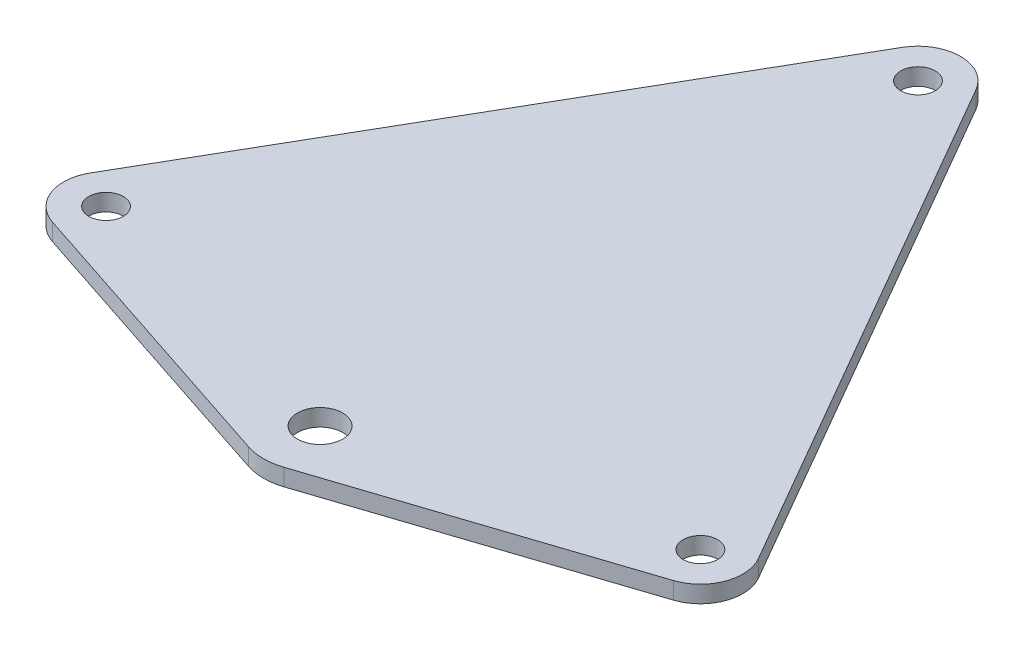
ISO-10303-21;
HEADER;
FILE_DESCRIPTION(('STEP AP214'),'2;1');
FILE_NAME('part.step','',(''),(''),'','','');
FILE_SCHEMA(('AUTOMOTIVE_DESIGN { 1 0 10303 214 1 1 1 1 }'));
ENDSEC;
DATA;
#1=APPLICATION_CONTEXT('core data for automotive mechanical design processes');
#2=APPLICATION_PROTOCOL_DEFINITION('international standard','automotive_design',2000,#1);
#3=PRODUCT_CONTEXT('',#1,'mechanical');
#4=PRODUCT('Part','Part','',(#3));
#5=PRODUCT_RELATED_PRODUCT_CATEGORY('part','',(#4));
#6=PRODUCT_DEFINITION_FORMATION('','',#4);
#7=PRODUCT_DEFINITION_CONTEXT('part definition',#1,'design');
#8=PRODUCT_DEFINITION('design','',#6,#7);
#9=PRODUCT_DEFINITION_SHAPE('','',#8);
#10=(LENGTH_UNIT() NAMED_UNIT(*) SI_UNIT(.MILLI.,.METRE.));
#11=(NAMED_UNIT(*) PLANE_ANGLE_UNIT() SI_UNIT($,.RADIAN.));
#12=(NAMED_UNIT(*) SI_UNIT($,.STERADIAN.) SOLID_ANGLE_UNIT());
#13=UNCERTAINTY_MEASURE_WITH_UNIT(LENGTH_MEASURE(1.E-05),#10,'distance_accuracy_value','');
#14=(GEOMETRIC_REPRESENTATION_CONTEXT(3) GLOBAL_UNCERTAINTY_ASSIGNED_CONTEXT((#13)) GLOBAL_UNIT_ASSIGNED_CONTEXT((#10,
#11,#12)) REPRESENTATION_CONTEXT('',''));
#15=CARTESIAN_POINT('',(0.,0.,0.));
#16=DIRECTION('',(0.,0.,1.));
#17=DIRECTION('',(1.,0.,0.));
#18=AXIS2_PLACEMENT_3D('',#15,#16,#17);
#19=CARTESIAN_POINT('',(-52.5,3.,30.3108891324553));
#20=DIRECTION('',(0.,-1.,0.));
#21=DIRECTION('',(0.,0.,-1.));
#22=AXIS2_PLACEMENT_3D('',#19,#20,#21);
#23=CYLINDRICAL_SURFACE('',#22,7.5);
#24=CARTESIAN_POINT('',(-52.5,0.,30.3108891324553));
#25=DIRECTION('',(0.,1.,0.));
#26=DIRECTION('',(0.,0.,1.));
#27=AXIS2_PLACEMENT_3D('',#24,#25,#26);
#28=CIRCLE('',#27,7.5);
#29=CARTESIAN_POINT('',(-54.8499234084128,0.,37.4332384621775));
#30=VERTEX_POINT('',#29);
#31=CARTESIAN_POINT('',(-58.9951905283833,0.,26.5608891324553));
#32=VERTEX_POINT('',#31);
#33=EDGE_CURVE('E146',#30,#32,#28,.F.);
#34=ORIENTED_EDGE('',*,*,#33,.F.);
#35=DIRECTION('',(0.,-1.,0.));
#36=VECTOR('',#35,1.);
#37=CARTESIAN_POINT('',(-54.8499234084128,3.,37.4332384621775));
#38=LINE('',#37,#36);
#39=CARTESIAN_POINT('',(-54.8499234084128,3.,37.4332384621775));
#40=VERTEX_POINT('',#39);
#41=EDGE_CURVE('E11',#40,#30,#38,.T.);
#42=ORIENTED_EDGE('',*,*,#41,.F.);
#43=CARTESIAN_POINT('',(-52.5,3.,30.3108891324553));
#44=DIRECTION('',(0.,1.,0.));
#45=DIRECTION('',(0.,0.,1.));
#46=AXIS2_PLACEMENT_3D('',#43,#44,#45);
#47=CIRCLE('',#46,7.5);
#48=CARTESIAN_POINT('',(-58.9951905283833,3.,26.5608891324553));
#49=VERTEX_POINT('',#48);
#50=EDGE_CURVE('E175',#40,#49,#47,.F.);
#51=ORIENTED_EDGE('',*,*,#50,.T.);
#52=DIRECTION('',(0.,-1.,0.));
#53=VECTOR('',#52,1.);
#54=CARTESIAN_POINT('',(-58.9951905283833,3.,26.5608891324553));
#55=LINE('',#54,#53);
#56=EDGE_CURVE('E89',#49,#32,#55,.T.);
#57=ORIENTED_EDGE('',*,*,#56,.T.);
#58=EDGE_LOOP('',(#34,#42,#51,#57));
#59=FACE_BOUND('',#58,.T.);
#60=ADVANCED_FACE('F39',(#59),#23,.T.);
#61=CARTESIAN_POINT('',(-16.5228115414628,3.,50.0787537526378));
#62=DIRECTION('',(0.313323121121704,0.,-0.949646577296288));
#63=DIRECTION('',(-0.949646577296288,0.,-0.313323121121704));
#64=AXIS2_PLACEMENT_3D('',#61,#62,#63);
#65=PLANE('',#64);
#66=DIRECTION('',(0.949646577296288,0.,0.313323121121704));
#67=VECTOR('',#66,1.);
#68=CARTESIAN_POINT('',(-16.5228115414628,0.,50.0787537526378));
#69=LINE('',#68,#67);
#70=CARTESIAN_POINT('',(-3.13323121121704,0.,54.4964657729629));
#71=VERTEX_POINT('',#70);
#72=EDGE_CURVE('E149',#30,#71,#69,.T.);
#73=ORIENTED_EDGE('',*,*,#72,.T.);
#74=DIRECTION('',(0.,-1.,0.));
#75=VECTOR('',#74,1.);
#76=CARTESIAN_POINT('',(-3.13323121121704,3.,54.4964657729629));
#77=LINE('',#76,#75);
#78=CARTESIAN_POINT('',(-3.13323121121704,3.,54.4964657729629));
#79=VERTEX_POINT('',#78);
#80=EDGE_CURVE('E47',#79,#71,#77,.T.);
#81=ORIENTED_EDGE('',*,*,#80,.F.);
#82=DIRECTION('',(0.949646577296288,0.,0.313323121121704));
#83=VECTOR('',#82,1.);
#84=CARTESIAN_POINT('',(-16.5228115414628,3.,50.0787537526378));
#85=LINE('',#84,#83);
#86=EDGE_CURVE('E202',#40,#79,#85,.T.);
#87=ORIENTED_EDGE('',*,*,#86,.F.);
#88=ORIENTED_EDGE('',*,*,#41,.T.);
#89=EDGE_LOOP('',(#73,#81,#87,#88));
#90=FACE_BOUND('',#89,.T.);
#91=ADVANCED_FACE('F206',(#90),#65,.F.);
#92=CARTESIAN_POINT('',(0.,3.,45.));
#93=DIRECTION('',(0.,-1.,0.));
#94=DIRECTION('',(0.,0.,-1.));
#95=AXIS2_PLACEMENT_3D('',#92,#93,#94);
#96=CYLINDRICAL_SURFACE('',#95,9.99999999999999);
#97=CARTESIAN_POINT('',(0.,0.,45.));
#98=DIRECTION('',(0.,1.,0.));
#99=DIRECTION('',(0.,0.,1.));
#100=AXIS2_PLACEMENT_3D('',#97,#98,#99);
#101=CIRCLE('',#100,9.99999999999999);
#102=CARTESIAN_POINT('',(3.13323121121705,0.,54.4964657729629));
#103=VERTEX_POINT('',#102);
#104=EDGE_CURVE('E151',#71,#103,#101,.T.);
#105=ORIENTED_EDGE('',*,*,#104,.T.);
#106=DIRECTION('',(0.,-1.,0.));
#107=VECTOR('',#106,1.);
#108=CARTESIAN_POINT('',(3.13323121121705,3.,54.4964657729629));
#109=LINE('',#108,#107);
#110=CARTESIAN_POINT('',(3.13323121121705,3.,54.4964657729629));
#111=VERTEX_POINT('',#110);
#112=EDGE_CURVE('E181',#111,#103,#109,.T.);
#113=ORIENTED_EDGE('',*,*,#112,.F.);
#114=CARTESIAN_POINT('',(0.,3.,45.));
#115=DIRECTION('',(0.,1.,0.));
#116=DIRECTION('',(0.,0.,1.));
#117=AXIS2_PLACEMENT_3D('',#114,#115,#116);
#118=CIRCLE('',#117,9.99999999999999);
#119=EDGE_CURVE('E190',#79,#111,#118,.T.);
#120=ORIENTED_EDGE('',*,*,#119,.F.);
#121=ORIENTED_EDGE('',*,*,#80,.T.);
#122=EDGE_LOOP('',(#105,#113,#120,#121));
#123=FACE_BOUND('',#122,.T.);
#124=ADVANCED_FACE('F188',(#123),#96,.T.);
#125=CARTESIAN_POINT('',(16.5228115414628,3.,50.0787537526378));
#126=DIRECTION('',(-0.313323121121704,0.,-0.949646577296288));
#127=DIRECTION('',(-0.949646577296288,0.,0.313323121121704));
#128=AXIS2_PLACEMENT_3D('',#125,#126,#127);
#129=PLANE('',#128);
#130=DIRECTION('',(0.949646577296288,0.,-0.313323121121704));
#131=VECTOR('',#130,1.);
#132=CARTESIAN_POINT('',(16.5228115414628,0.,50.0787537526378));
#133=LINE('',#132,#131);
#134=CARTESIAN_POINT('',(54.8499234084128,0.,37.4332384621775));
#135=VERTEX_POINT('',#134);
#136=EDGE_CURVE('E153',#103,#135,#133,.T.);
#137=ORIENTED_EDGE('',*,*,#136,.T.);
#138=DIRECTION('',(0.,-1.,0.));
#139=VECTOR('',#138,1.);
#140=CARTESIAN_POINT('',(54.8499234084128,3.,37.4332384621775));
#141=LINE('',#140,#139);
#142=CARTESIAN_POINT('',(54.8499234084128,3.,37.4332384621775));
#143=VERTEX_POINT('',#142);
#144=EDGE_CURVE('E179',#143,#135,#141,.T.);
#145=ORIENTED_EDGE('',*,*,#144,.F.);
#146=DIRECTION('',(0.949646577296288,0.,-0.313323121121704));
#147=VECTOR('',#146,1.);
#148=CARTESIAN_POINT('',(16.5228115414628,3.,50.0787537526378));
#149=LINE('',#148,#147);
#150=EDGE_CURVE('E129',#111,#143,#149,.T.);
#151=ORIENTED_EDGE('',*,*,#150,.F.);
#152=ORIENTED_EDGE('',*,*,#112,.T.);
#153=EDGE_LOOP('',(#137,#145,#151,#152));
#154=FACE_BOUND('',#153,.T.);
#155=ADVANCED_FACE('F200',(#154),#129,.F.);
#156=CARTESIAN_POINT('',(52.5,3.,30.3108891324553));
#157=DIRECTION('',(0.,-1.,0.));
#158=DIRECTION('',(0.,0.,-1.));
#159=AXIS2_PLACEMENT_3D('',#156,#157,#158);
#160=CYLINDRICAL_SURFACE('',#159,7.49999999999999);
#161=CARTESIAN_POINT('',(52.5,0.,30.3108891324553));
#162=DIRECTION('',(0.,1.,0.));
#163=DIRECTION('',(0.,0.,1.));
#164=AXIS2_PLACEMENT_3D('',#161,#162,#163);
#165=CIRCLE('',#164,7.49999999999999);
#166=CARTESIAN_POINT('',(58.9951905283833,0.,26.5608891324553));
#167=VERTEX_POINT('',#166);
#168=EDGE_CURVE('E156',#167,#135,#165,.F.);
#169=ORIENTED_EDGE('',*,*,#168,.F.);
#170=DIRECTION('',(0.,-1.,0.));
#171=VECTOR('',#170,1.);
#172=CARTESIAN_POINT('',(58.9951905283833,3.,26.5608891324553));
#173=LINE('',#172,#171);
#174=CARTESIAN_POINT('',(58.9951905283833,3.,26.5608891324553));
#175=VERTEX_POINT('',#174);
#176=EDGE_CURVE('E117',#175,#167,#173,.T.);
#177=ORIENTED_EDGE('',*,*,#176,.F.);
#178=CARTESIAN_POINT('',(52.5,3.,30.3108891324553));
#179=DIRECTION('',(0.,1.,0.));
#180=DIRECTION('',(0.,0.,1.));
#181=AXIS2_PLACEMENT_3D('',#178,#179,#180);
#182=CIRCLE('',#181,7.49999999999999);
#183=EDGE_CURVE('E127',#175,#143,#182,.F.);
#184=ORIENTED_EDGE('',*,*,#183,.T.);
#185=ORIENTED_EDGE('',*,*,#144,.T.);
#186=EDGE_LOOP('',(#169,#177,#184,#185));
#187=FACE_BOUND('',#186,.T.);
#188=ADVANCED_FACE('F216',(#187),#160,.T.);
#189=CARTESIAN_POINT('',(32.7451905283833,3.,-18.9054445662277));
#190=DIRECTION('',(0.866025403784439,0.,-0.5));
#191=DIRECTION('',(-0.5,0.,-0.866025403784439));
#192=AXIS2_PLACEMENT_3D('',#189,#190,#191);
#193=PLANE('',#192);
#194=DIRECTION('',(0.5,0.,0.866025403784439));
#195=VECTOR('',#194,1.);
#196=CARTESIAN_POINT('',(32.7451905283833,0.,-18.9054445662277));
#197=LINE('',#196,#195);
#198=CARTESIAN_POINT('',(6.4951905283833,0.,-64.3717782649107));
#199=VERTEX_POINT('',#198);
#200=EDGE_CURVE('E116',#199,#167,#197,.T.);
#201=ORIENTED_EDGE('',*,*,#200,.F.);
#202=DIRECTION('',(0.,-1.,0.));
#203=VECTOR('',#202,1.);
#204=CARTESIAN_POINT('',(6.4951905283833,3.,-64.3717782649107));
#205=LINE('',#204,#203);
#206=CARTESIAN_POINT('',(6.4951905283833,3.,-64.3717782649107));
#207=VERTEX_POINT('',#206);
#208=EDGE_CURVE('E110',#207,#199,#205,.T.);
#209=ORIENTED_EDGE('',*,*,#208,.F.);
#210=DIRECTION('',(0.5,0.,0.866025403784439));
#211=VECTOR('',#210,1.);
#212=CARTESIAN_POINT('',(32.7451905283833,3.,-18.9054445662277));
#213=LINE('',#212,#211);
#214=EDGE_CURVE('E114',#207,#175,#213,.T.);
#215=ORIENTED_EDGE('',*,*,#214,.T.);
#216=ORIENTED_EDGE('',*,*,#176,.T.);
#217=EDGE_LOOP('',(#201,#209,#215,#216));
#218=FACE_BOUND('',#217,.T.);
#219=ADVANCED_FACE('F112',(#218),#193,.T.);
#220=CARTESIAN_POINT('',(0.,3.,-60.6217782649107));
#221=DIRECTION('',(0.,-1.,0.));
#222=DIRECTION('',(0.,0.,-1.));
#223=AXIS2_PLACEMENT_3D('',#220,#221,#222);
#224=CYLINDRICAL_SURFACE('',#223,7.5);
#225=CARTESIAN_POINT('',(0.,0.,-60.6217782649107));
#226=DIRECTION('',(0.,1.,0.));
#227=DIRECTION('',(0.,0.,1.));
#228=AXIS2_PLACEMENT_3D('',#225,#226,#227);
#229=CIRCLE('',#228,7.5);
#230=CARTESIAN_POINT('',(-6.4951905283833,0.,-64.3717782649107));
#231=VERTEX_POINT('',#230);
#232=EDGE_CURVE('E82',#199,#231,#229,.T.);
#233=ORIENTED_EDGE('',*,*,#232,.T.);
#234=DIRECTION('',(0.,-1.,0.));
#235=VECTOR('',#234,1.);
#236=CARTESIAN_POINT('',(-6.4951905283833,3.,-64.3717782649107));
#237=LINE('',#236,#235);
#238=CARTESIAN_POINT('',(-6.4951905283833,3.,-64.3717782649107));
#239=VERTEX_POINT('',#238);
#240=EDGE_CURVE('E118',#239,#231,#237,.T.);
#241=ORIENTED_EDGE('',*,*,#240,.F.);
#242=CARTESIAN_POINT('',(0.,3.,-60.6217782649107));
#243=DIRECTION('',(0.,1.,0.));
#244=DIRECTION('',(0.,0.,1.));
#245=AXIS2_PLACEMENT_3D('',#242,#243,#244);
#246=CIRCLE('',#245,7.5);
#247=EDGE_CURVE('E120',#207,#239,#246,.T.);
#248=ORIENTED_EDGE('',*,*,#247,.F.);
#249=ORIENTED_EDGE('',*,*,#208,.T.);
#250=EDGE_LOOP('',(#233,#241,#248,#249));
#251=FACE_BOUND('',#250,.T.);
#252=ADVANCED_FACE('F121',(#251),#224,.T.);
#253=CARTESIAN_POINT('',(0.,3.,-60.6217782649107));
#254=DIRECTION('',(0.,-1.,0.));
#255=DIRECTION('',(0.,0.,-1.));
#256=AXIS2_PLACEMENT_3D('',#253,#254,#255);
#257=CYLINDRICAL_SURFACE('',#256,3.05);
#258=CARTESIAN_POINT('',(0.,3.,-60.6217782649107));
#259=DIRECTION('',(0.,1.,0.));
#260=DIRECTION('',(0.,0.,1.));
#261=AXIS2_PLACEMENT_3D('',#258,#259,#260);
#262=CIRCLE('',#261,3.05);
#263=CARTESIAN_POINT('',(0.,3.,-57.5717782649107));
#264=VERTEX_POINT('',#263);
#265=EDGE_CURVE('E140',#264,#264,#262,.T.);
#266=ORIENTED_EDGE('',*,*,#265,.T.);
#267=EDGE_LOOP('',(#266));
#268=FACE_BOUND('',#267,.T.);
#269=CARTESIAN_POINT('',(0.,0.,-60.6217782649107));
#270=DIRECTION('',(0.,1.,0.));
#271=DIRECTION('',(0.,0.,1.));
#272=AXIS2_PLACEMENT_3D('',#269,#270,#271);
#273=CIRCLE('',#272,3.05);
#274=CARTESIAN_POINT('',(0.,0.,-57.5717782649107));
#275=VERTEX_POINT('',#274);
#276=EDGE_CURVE('E169',#275,#275,#273,.T.);
#277=ORIENTED_EDGE('',*,*,#276,.F.);
#278=EDGE_LOOP('',(#277));
#279=FACE_BOUND('',#278,.T.);
#280=ADVANCED_FACE('F224',(#268,#279),#257,.F.);
#281=CARTESIAN_POINT('',(52.5,3.,30.3108891324553));
#282=DIRECTION('',(0.,-1.,0.));
#283=DIRECTION('',(0.,0.,-1.));
#284=AXIS2_PLACEMENT_3D('',#281,#282,#283);
#285=CYLINDRICAL_SURFACE('',#284,3.05);
#286=CARTESIAN_POINT('',(52.5,3.,30.3108891324553));
#287=DIRECTION('',(0.,1.,0.));
#288=DIRECTION('',(0.,0.,1.));
#289=AXIS2_PLACEMENT_3D('',#286,#287,#288);
#290=CIRCLE('',#289,3.05);
#291=CARTESIAN_POINT('',(52.5,3.,33.3608891324553));
#292=VERTEX_POINT('',#291);
#293=EDGE_CURVE('E137',#292,#292,#290,.T.);
#294=ORIENTED_EDGE('',*,*,#293,.T.);
#295=EDGE_LOOP('',(#294));
#296=FACE_BOUND('',#295,.T.);
#297=CARTESIAN_POINT('',(52.5,0.,30.3108891324553));
#298=DIRECTION('',(0.,1.,0.));
#299=DIRECTION('',(0.,0.,1.));
#300=AXIS2_PLACEMENT_3D('',#297,#298,#299);
#301=CIRCLE('',#300,3.05);
#302=CARTESIAN_POINT('',(52.5,0.,33.3608891324553));
#303=VERTEX_POINT('',#302);
#304=EDGE_CURVE('E166',#303,#303,#301,.T.);
#305=ORIENTED_EDGE('',*,*,#304,.F.);
#306=EDGE_LOOP('',(#305));
#307=FACE_BOUND('',#306,.T.);
#308=ADVANCED_FACE('F233',(#296,#307),#285,.F.);
#309=CARTESIAN_POINT('',(-52.5,3.,30.3108891324553));
#310=DIRECTION('',(0.,-1.,0.));
#311=DIRECTION('',(0.,0.,-1.));
#312=AXIS2_PLACEMENT_3D('',#309,#310,#311);
#313=CYLINDRICAL_SURFACE('',#312,3.05);
#314=CARTESIAN_POINT('',(-52.5,3.,30.3108891324553));
#315=DIRECTION('',(0.,1.,0.));
#316=DIRECTION('',(0.,0.,1.));
#317=AXIS2_PLACEMENT_3D('',#314,#315,#316);
#318=CIRCLE('',#317,3.05);
#319=CARTESIAN_POINT('',(-52.5,3.,33.3608891324553));
#320=VERTEX_POINT('',#319);
#321=EDGE_CURVE('E134',#320,#320,#318,.T.);
#322=ORIENTED_EDGE('',*,*,#321,.T.);
#323=EDGE_LOOP('',(#322));
#324=FACE_BOUND('',#323,.T.);
#325=CARTESIAN_POINT('',(-52.5,0.,30.3108891324553));
#326=DIRECTION('',(0.,1.,0.));
#327=DIRECTION('',(0.,0.,1.));
#328=AXIS2_PLACEMENT_3D('',#325,#326,#327);
#329=CIRCLE('',#328,3.05);
#330=CARTESIAN_POINT('',(-52.5,0.,33.3608891324553));
#331=VERTEX_POINT('',#330);
#332=EDGE_CURVE('E163',#331,#331,#329,.T.);
#333=ORIENTED_EDGE('',*,*,#332,.F.);
#334=EDGE_LOOP('',(#333));
#335=FACE_BOUND('',#334,.T.);
#336=ADVANCED_FACE('F229',(#324,#335),#313,.F.);
#337=CARTESIAN_POINT('',(-32.7451905283833,3.,-18.9054445662277));
#338=DIRECTION('',(0.866025403784438,0.,0.5));
#339=DIRECTION('',(0.5,0.,-0.866025403784439));
#340=AXIS2_PLACEMENT_3D('',#337,#338,#339);
#341=PLANE('',#340);
#342=DIRECTION('',(-0.5,0.,0.866025403784439));
#343=VECTOR('',#342,1.);
#344=CARTESIAN_POINT('',(-32.7451905283833,0.,-18.9054445662277));
#345=LINE('',#344,#343);
#346=EDGE_CURVE('E161',#231,#32,#345,.T.);
#347=ORIENTED_EDGE('',*,*,#346,.T.);
#348=ORIENTED_EDGE('',*,*,#56,.F.);
#349=DIRECTION('',(-0.5,0.,0.866025403784439));
#350=VECTOR('',#349,1.);
#351=CARTESIAN_POINT('',(-32.7451905283833,3.,-18.9054445662277));
#352=LINE('',#351,#350);
#353=EDGE_CURVE('E55',#239,#49,#352,.T.);
#354=ORIENTED_EDGE('',*,*,#353,.F.);
#355=ORIENTED_EDGE('',*,*,#240,.T.);
#356=EDGE_LOOP('',(#347,#348,#354,#355));
#357=FACE_BOUND('',#356,.T.);
#358=ADVANCED_FACE('F225',(#357),#341,.F.);
#359=CARTESIAN_POINT('',(0.,3.,45.));
#360=DIRECTION('',(0.,-1.,0.));
#361=DIRECTION('',(0.,0.,-1.));
#362=AXIS2_PLACEMENT_3D('',#359,#360,#361);
#363=CYLINDRICAL_SURFACE('',#362,4.);
#364=CARTESIAN_POINT('',(0.,3.,45.));
#365=DIRECTION('',(0.,1.,0.));
#366=DIRECTION('',(0.,0.,1.));
#367=AXIS2_PLACEMENT_3D('',#364,#365,#366);
#368=CIRCLE('',#367,4.);
#369=CARTESIAN_POINT('',(0.,3.,49.));
#370=VERTEX_POINT('',#369);
#371=EDGE_CURVE('E143',#370,#370,#368,.T.);
#372=ORIENTED_EDGE('',*,*,#371,.T.);
#373=EDGE_LOOP('',(#372));
#374=FACE_BOUND('',#373,.T.);
#375=CARTESIAN_POINT('',(0.,0.,45.));
#376=DIRECTION('',(0.,1.,0.));
#377=DIRECTION('',(0.,0.,1.));
#378=AXIS2_PLACEMENT_3D('',#375,#376,#377);
#379=CIRCLE('',#378,4.);
#380=CARTESIAN_POINT('',(0.,0.,49.));
#381=VERTEX_POINT('',#380);
#382=EDGE_CURVE('E172',#381,#381,#379,.T.);
#383=ORIENTED_EDGE('',*,*,#382,.F.);
#384=EDGE_LOOP('',(#383));
#385=FACE_BOUND('',#384,.T.);
#386=ADVANCED_FACE('F228',(#374,#385),#363,.F.);
#387=CARTESIAN_POINT('',(0.,3.,0.));
#388=DIRECTION('',(0.,1.,0.));
#389=DIRECTION('',(0.,0.,1.));
#390=AXIS2_PLACEMENT_3D('',#387,#388,#389);
#391=PLANE('',#390);
#392=ORIENTED_EDGE('',*,*,#50,.F.);
#393=ORIENTED_EDGE('',*,*,#86,.T.);
#394=ORIENTED_EDGE('',*,*,#119,.T.);
#395=ORIENTED_EDGE('',*,*,#150,.T.);
#396=ORIENTED_EDGE('',*,*,#183,.F.);
#397=ORIENTED_EDGE('',*,*,#214,.F.);
#398=ORIENTED_EDGE('',*,*,#247,.T.);
#399=ORIENTED_EDGE('',*,*,#353,.T.);
#400=EDGE_LOOP('',(#392,#393,#394,#395,#396,#397,#398,#399));
#401=FACE_BOUND('',#400,.T.);
#402=ORIENTED_EDGE('',*,*,#321,.F.);
#403=EDGE_LOOP('',(#402));
#404=FACE_BOUND('',#403,.T.);
#405=ORIENTED_EDGE('',*,*,#293,.F.);
#406=EDGE_LOOP('',(#405));
#407=FACE_BOUND('',#406,.T.);
#408=ORIENTED_EDGE('',*,*,#265,.F.);
#409=EDGE_LOOP('',(#408));
#410=FACE_BOUND('',#409,.T.);
#411=ORIENTED_EDGE('',*,*,#371,.F.);
#412=EDGE_LOOP('',(#411));
#413=FACE_BOUND('',#412,.T.);
#414=ADVANCED_FACE('F124',(#401,#404,#407,#410,#413),#391,.T.);
#415=CARTESIAN_POINT('',(0.,0.,0.));
#416=DIRECTION('',(0.,1.,0.));
#417=DIRECTION('',(0.,0.,1.));
#418=AXIS2_PLACEMENT_3D('',#415,#416,#417);
#419=PLANE('',#418);
#420=ORIENTED_EDGE('',*,*,#33,.T.);
#421=ORIENTED_EDGE('',*,*,#346,.F.);
#422=ORIENTED_EDGE('',*,*,#232,.F.);
#423=ORIENTED_EDGE('',*,*,#200,.T.);
#424=ORIENTED_EDGE('',*,*,#168,.T.);
#425=ORIENTED_EDGE('',*,*,#136,.F.);
#426=ORIENTED_EDGE('',*,*,#104,.F.);
#427=ORIENTED_EDGE('',*,*,#72,.F.);
#428=EDGE_LOOP('',(#420,#421,#422,#423,#424,#425,#426,#427));
#429=FACE_BOUND('',#428,.T.);
#430=ORIENTED_EDGE('',*,*,#332,.T.);
#431=EDGE_LOOP('',(#430));
#432=FACE_BOUND('',#431,.T.);
#433=ORIENTED_EDGE('',*,*,#304,.T.);
#434=EDGE_LOOP('',(#433));
#435=FACE_BOUND('',#434,.T.);
#436=ORIENTED_EDGE('',*,*,#276,.T.);
#437=EDGE_LOOP('',(#436));
#438=FACE_BOUND('',#437,.T.);
#439=ORIENTED_EDGE('',*,*,#382,.T.);
#440=EDGE_LOOP('',(#439));
#441=FACE_BOUND('',#440,.T.);
#442=ADVANCED_FACE('F195',(#429,#432,#435,#438,#441),#419,.F.);
#443=CLOSED_SHELL('',(#60,#91,#124,#155,#188,#219,#252,#280,#308,#336,#358,#386,#414,#442));
#444=MANIFOLD_SOLID_BREP('B2',#443);
#445=ADVANCED_BREP_SHAPE_REPRESENTATION('',(#18,#444),#14);
#446=SHAPE_DEFINITION_REPRESENTATION(#9,#445);
ENDSEC;
END-ISO-10303-21;
